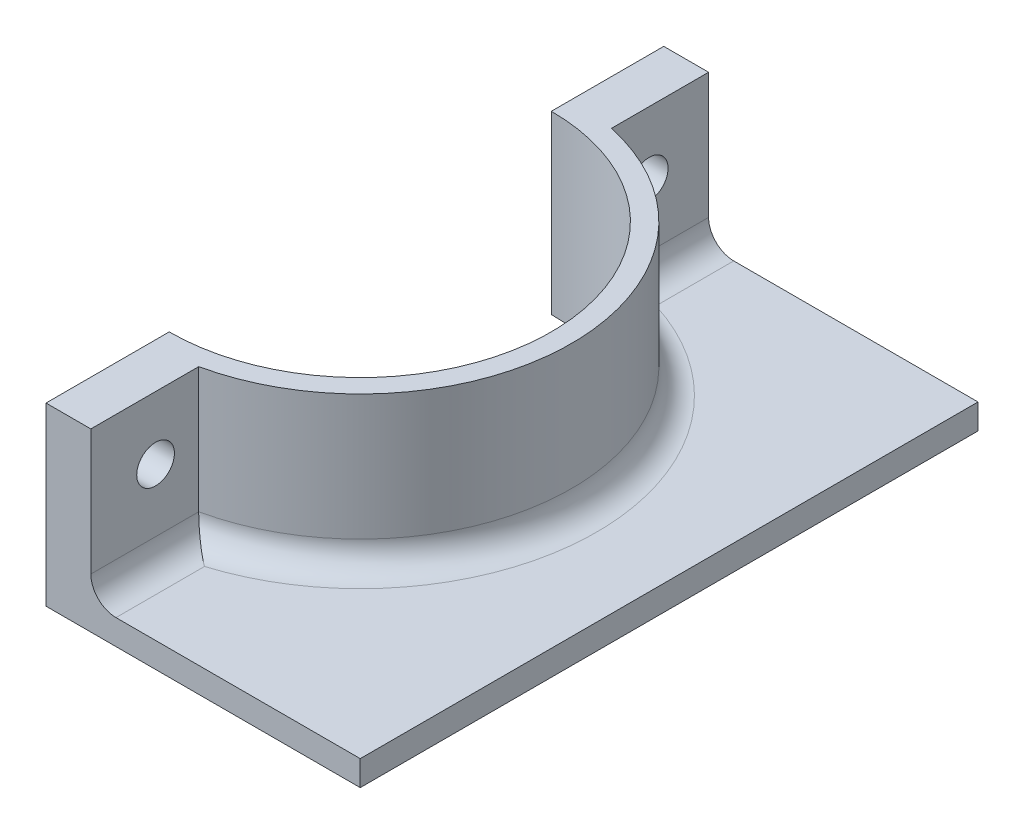
ISO-10303-21;
HEADER;
FILE_DESCRIPTION(('STEP AP214'),'2;1');
FILE_NAME('part.step','',(''),(''),'','','');
FILE_SCHEMA(('AUTOMOTIVE_DESIGN { 1 0 10303 214 1 1 1 1 }'));
ENDSEC;
DATA;
#1=APPLICATION_CONTEXT('core data for automotive mechanical design processes');
#2=APPLICATION_PROTOCOL_DEFINITION('international standard','automotive_design',2000,#1);
#3=PRODUCT_CONTEXT('',#1,'mechanical');
#4=PRODUCT('Part','Part','',(#3));
#5=PRODUCT_RELATED_PRODUCT_CATEGORY('part','',(#4));
#6=PRODUCT_DEFINITION_FORMATION('','',#4);
#7=PRODUCT_DEFINITION_CONTEXT('part definition',#1,'design');
#8=PRODUCT_DEFINITION('design','',#6,#7);
#9=PRODUCT_DEFINITION_SHAPE('','',#8);
#10=(LENGTH_UNIT() NAMED_UNIT(*) SI_UNIT(.MILLI.,.METRE.));
#11=(NAMED_UNIT(*) PLANE_ANGLE_UNIT() SI_UNIT($,.RADIAN.));
#12=(NAMED_UNIT(*) SI_UNIT($,.STERADIAN.) SOLID_ANGLE_UNIT());
#13=UNCERTAINTY_MEASURE_WITH_UNIT(LENGTH_MEASURE(1.E-05),#10,'distance_accuracy_value','');
#14=(GEOMETRIC_REPRESENTATION_CONTEXT(3) GLOBAL_UNCERTAINTY_ASSIGNED_CONTEXT((#13)) GLOBAL_UNIT_ASSIGNED_CONTEXT((#10,
#11,#12)) REPRESENTATION_CONTEXT('',''));
#15=CARTESIAN_POINT('',(0.,0.,0.));
#16=DIRECTION('',(0.,0.,1.));
#17=DIRECTION('',(1.,0.,0.));
#18=AXIS2_PLACEMENT_3D('',#15,#16,#17);
#19=CARTESIAN_POINT('',(29.9298320555893,17.78,0.));
#20=DIRECTION('',(-1.,0.,0.));
#21=DIRECTION('',(0.,0.,1.));
#22=AXIS2_PLACEMENT_3D('',#19,#20,#21);
#23=PLANE('',#22);
#24=CARTESIAN_POINT('',(29.9298320555893,11.43,-6.5405));
#25=DIRECTION('',(-1.,0.,0.));
#26=DIRECTION('',(0.,0.,1.));
#27=AXIS2_PLACEMENT_3D('',#24,#25,#26);
#28=CIRCLE('',#27,1.905);
#29=CARTESIAN_POINT('',(29.9298320555893,11.43,-4.6355));
#30=VERTEX_POINT('',#29);
#31=EDGE_CURVE('E342',#30,#30,#28,.F.);
#32=ORIENTED_EDGE('',*,*,#31,.F.);
#33=EDGE_LOOP('',(#32));
#34=FACE_BOUND('',#33,.T.);
#35=DIRECTION('',(0.,-1.,0.));
#36=VECTOR('',#35,1.);
#37=CARTESIAN_POINT('',(29.9298320555893,17.78,0.));
#38=LINE('',#37,#36);
#39=CARTESIAN_POINT('',(29.9298320555893,17.78,0.));
#40=VERTEX_POINT('',#39);
#41=CARTESIAN_POINT('',(29.9298320555893,5.08,0.));
#42=VERTEX_POINT('',#41);
#43=EDGE_CURVE('E202',#40,#42,#38,.T.);
#44=ORIENTED_EDGE('',*,*,#43,.T.);
#45=DIRECTION('',(0.,0.,-1.));
#46=VECTOR('',#45,1.);
#47=CARTESIAN_POINT('',(29.9298320555893,5.08,0.));
#48=LINE('',#47,#46);
#49=CARTESIAN_POINT('',(29.9298320555893,5.08,-10.9004072570193));
#50=VERTEX_POINT('',#49);
#51=EDGE_CURVE('E69',#42,#50,#48,.T.);
#52=ORIENTED_EDGE('',*,*,#51,.T.);
#53=DIRECTION('',(0.,-1.,0.));
#54=VECTOR('',#53,1.);
#55=CARTESIAN_POINT('',(29.9298320555893,17.78,-10.9004072570193));
#56=LINE('',#55,#54);
#57=CARTESIAN_POINT('',(29.9298320555893,17.78,-10.9004072570193));
#58=VERTEX_POINT('',#57);
#59=EDGE_CURVE('E238',#58,#50,#56,.T.);
#60=ORIENTED_EDGE('',*,*,#59,.F.);
#61=DIRECTION('',(0.,0.,-1.));
#62=VECTOR('',#61,1.);
#63=CARTESIAN_POINT('',(29.9298320555893,17.78,0.));
#64=LINE('',#63,#62);
#65=EDGE_CURVE('E175',#40,#58,#64,.T.);
#66=ORIENTED_EDGE('',*,*,#65,.F.);
#67=EDGE_LOOP('',(#44,#52,#60,#66));
#68=FACE_BOUND('',#67,.T.);
#69=ADVANCED_FACE('F45',(#34,#68),#23,.F.);
#70=CARTESIAN_POINT('',(25.4,17.78,-31.75));
#71=DIRECTION('',(0.,-1.,0.));
#72=DIRECTION('',(0.,0.,-1.));
#73=AXIS2_PLACEMENT_3D('',#70,#71,#72);
#74=CYLINDRICAL_SURFACE('',#73,21.336);
#75=ORIENTED_EDGE('',*,*,#59,.T.);
#76=CARTESIAN_POINT('',(25.4,5.08,-31.75));
#77=DIRECTION('',(0.,1.,0.));
#78=DIRECTION('',(0.,0.,1.));
#79=AXIS2_PLACEMENT_3D('',#76,#77,#78);
#80=CIRCLE('',#79,21.336);
#81=CARTESIAN_POINT('',(29.9298320555893,5.08,-52.5995927429807));
#82=VERTEX_POINT('',#81);
#83=EDGE_CURVE('E253',#50,#82,#80,.T.);
#84=ORIENTED_EDGE('',*,*,#83,.T.);
#85=DIRECTION('',(0.,-1.,0.));
#86=VECTOR('',#85,1.);
#87=CARTESIAN_POINT('',(29.9298320555893,17.78,-52.5995927429807));
#88=LINE('',#87,#86);
#89=CARTESIAN_POINT('',(29.9298320555893,17.78,-52.5995927429807));
#90=VERTEX_POINT('',#89);
#91=EDGE_CURVE('E234',#90,#82,#88,.T.);
#92=ORIENTED_EDGE('',*,*,#91,.F.);
#93=CARTESIAN_POINT('',(25.4,17.78,-31.75));
#94=DIRECTION('',(0.,1.,0.));
#95=DIRECTION('',(0.,0.,1.));
#96=AXIS2_PLACEMENT_3D('',#93,#94,#95);
#97=CIRCLE('',#96,21.336);
#98=EDGE_CURVE('E179',#58,#90,#97,.T.);
#99=ORIENTED_EDGE('',*,*,#98,.F.);
#100=EDGE_LOOP('',(#75,#84,#92,#99));
#101=FACE_BOUND('',#100,.T.);
#102=ADVANCED_FACE('F291',(#101),#74,.T.);
#103=CARTESIAN_POINT('',(29.9298320555893,17.78,0.));
#104=DIRECTION('',(1.,0.,0.));
#105=DIRECTION('',(0.,0.,-1.));
#106=AXIS2_PLACEMENT_3D('',#103,#104,#105);
#107=PLANE('',#106);
#108=CARTESIAN_POINT('',(29.9298320555893,11.43,-56.417624590122));
#109=DIRECTION('',(1.,0.,0.));
#110=DIRECTION('',(0.,0.,-1.));
#111=AXIS2_PLACEMENT_3D('',#108,#109,#110);
#112=CIRCLE('',#111,1.905);
#113=CARTESIAN_POINT('',(29.9298320555893,11.43,-58.322624590122));
#114=VERTEX_POINT('',#113);
#115=EDGE_CURVE('E268',#114,#114,#112,.F.);
#116=ORIENTED_EDGE('',*,*,#115,.T.);
#117=EDGE_LOOP('',(#116));
#118=FACE_BOUND('',#117,.T.);
#119=ORIENTED_EDGE('',*,*,#91,.T.);
#120=DIRECTION('',(0.,0.,1.));
#121=VECTOR('',#120,1.);
#122=CARTESIAN_POINT('',(29.9298320555893,5.08,-62.416249180244));
#123=LINE('',#122,#121);
#124=CARTESIAN_POINT('',(29.9298320555893,5.08,-62.416249180244));
#125=VERTEX_POINT('',#124);
#126=EDGE_CURVE('E250',#82,#125,#123,.F.);
#127=ORIENTED_EDGE('',*,*,#126,.T.);
#128=DIRECTION('',(0.,-1.,0.));
#129=VECTOR('',#128,1.);
#130=CARTESIAN_POINT('',(29.9298320555893,17.78,-62.416249180244));
#131=LINE('',#130,#129);
#132=CARTESIAN_POINT('',(29.9298320555893,17.78,-62.416249180244));
#133=VERTEX_POINT('',#132);
#134=EDGE_CURVE('E230',#133,#125,#131,.T.);
#135=ORIENTED_EDGE('',*,*,#134,.F.);
#136=DIRECTION('',(0.,0.,1.));
#137=VECTOR('',#136,1.);
#138=CARTESIAN_POINT('',(29.9298320555893,17.78,0.));
#139=LINE('',#138,#137);
#140=EDGE_CURVE('E182',#133,#90,#139,.T.);
#141=ORIENTED_EDGE('',*,*,#140,.T.);
#142=EDGE_LOOP('',(#119,#127,#135,#141));
#143=FACE_BOUND('',#142,.T.);
#144=ADVANCED_FACE('F296',(#118,#143),#107,.T.);
#145=CARTESIAN_POINT('',(0.,17.78,-62.416249180244));
#146=DIRECTION('',(0.,0.,-1.));
#147=DIRECTION('',(-1.,0.,0.));
#148=AXIS2_PLACEMENT_3D('',#145,#146,#147);
#149=PLANE('',#148);
#150=DIRECTION('',(1.,0.,0.));
#151=VECTOR('',#150,1.);
#152=CARTESIAN_POINT('',(0.,0.,-62.416249180244));
#153=LINE('',#152,#151);
#154=CARTESIAN_POINT('',(25.4,0.,-62.416249180244));
#155=VERTEX_POINT('',#154);
#156=CARTESIAN_POINT('',(57.15,0.,-62.416249180244));
#157=VERTEX_POINT('',#156);
#158=EDGE_CURVE('E147',#155,#157,#153,.T.);
#159=ORIENTED_EDGE('',*,*,#158,.F.);
#160=DIRECTION('',(0.,-1.,0.));
#161=VECTOR('',#160,1.);
#162=CARTESIAN_POINT('',(25.4,17.78,-62.416249180244));
#163=LINE('',#162,#161);
#164=CARTESIAN_POINT('',(25.4,17.78,-62.416249180244));
#165=VERTEX_POINT('',#164);
#166=EDGE_CURVE('E227',#165,#155,#163,.T.);
#167=ORIENTED_EDGE('',*,*,#166,.F.);
#168=DIRECTION('',(1.,0.,0.));
#169=VECTOR('',#168,1.);
#170=CARTESIAN_POINT('',(0.,17.78,-62.416249180244));
#171=LINE('',#170,#169);
#172=EDGE_CURVE('E186',#165,#133,#171,.T.);
#173=ORIENTED_EDGE('',*,*,#172,.T.);
#174=ORIENTED_EDGE('',*,*,#134,.T.);
#175=CARTESIAN_POINT('',(32.4698320555893,5.08,-62.416249180244));
#176=DIRECTION('',(0.,0.,-1.));
#177=DIRECTION('',(-1.,0.,0.));
#178=AXIS2_PLACEMENT_3D('',#175,#176,#177);
#179=CIRCLE('',#178,2.54);
#180=CARTESIAN_POINT('',(32.4698320555893,2.54,-62.416249180244));
#181=VERTEX_POINT('',#180);
#182=EDGE_CURVE('E56',#125,#181,#179,.F.);
#183=ORIENTED_EDGE('',*,*,#182,.T.);
#184=DIRECTION('',(1.,0.,0.));
#185=VECTOR('',#184,1.);
#186=CARTESIAN_POINT('',(0.,2.54,-62.416249180244));
#187=LINE('',#186,#185);
#188=CARTESIAN_POINT('',(57.15,2.54,-62.416249180244));
#189=VERTEX_POINT('',#188);
#190=EDGE_CURVE('E164',#181,#189,#187,.T.);
#191=ORIENTED_EDGE('',*,*,#190,.T.);
#192=DIRECTION('',(0.,-1.,0.));
#193=VECTOR('',#192,1.);
#194=CARTESIAN_POINT('',(57.15,2.54,-62.416249180244));
#195=LINE('',#194,#193);
#196=EDGE_CURVE('E148',#189,#157,#195,.T.);
#197=ORIENTED_EDGE('',*,*,#196,.T.);
#198=EDGE_LOOP('',(#159,#167,#173,#174,#183,#191,#197));
#199=FACE_BOUND('',#198,.T.);
#200=ADVANCED_FACE('F303',(#199),#149,.T.);
#201=CARTESIAN_POINT('',(25.4,17.78,0.));
#202=DIRECTION('',(1.,0.,0.));
#203=DIRECTION('',(0.,0.,-1.));
#204=AXIS2_PLACEMENT_3D('',#201,#202,#203);
#205=PLANE('',#204);
#206=CARTESIAN_POINT('',(25.4,11.43,-56.417624590122));
#207=DIRECTION('',(1.,0.,0.));
#208=DIRECTION('',(0.,0.,-1.));
#209=AXIS2_PLACEMENT_3D('',#206,#207,#208);
#210=CIRCLE('',#209,1.905);
#211=CARTESIAN_POINT('',(25.4,11.43,-58.322624590122));
#212=VERTEX_POINT('',#211);
#213=EDGE_CURVE('E50',#212,#212,#210,.F.);
#214=ORIENTED_EDGE('',*,*,#213,.F.);
#215=EDGE_LOOP('',(#214));
#216=FACE_BOUND('',#215,.T.);
#217=DIRECTION('',(0.,0.,1.));
#218=VECTOR('',#217,1.);
#219=CARTESIAN_POINT('',(25.4,0.,0.));
#220=LINE('',#219,#218);
#221=CARTESIAN_POINT('',(25.4,0.,-51.054));
#222=VERTEX_POINT('',#221);
#223=EDGE_CURVE('E205',#155,#222,#220,.T.);
#224=ORIENTED_EDGE('',*,*,#223,.T.);
#225=DIRECTION('',(0.,-1.,0.));
#226=VECTOR('',#225,1.);
#227=CARTESIAN_POINT('',(25.4,17.78,-51.054));
#228=LINE('',#227,#226);
#229=CARTESIAN_POINT('',(25.4,17.78,-51.054));
#230=VERTEX_POINT('',#229);
#231=EDGE_CURVE('E224',#230,#222,#228,.T.);
#232=ORIENTED_EDGE('',*,*,#231,.F.);
#233=DIRECTION('',(0.,0.,1.));
#234=VECTOR('',#233,1.);
#235=CARTESIAN_POINT('',(25.4,17.78,0.));
#236=LINE('',#235,#234);
#237=EDGE_CURVE('E190',#165,#230,#236,.T.);
#238=ORIENTED_EDGE('',*,*,#237,.F.);
#239=ORIENTED_EDGE('',*,*,#166,.T.);
#240=EDGE_LOOP('',(#224,#232,#238,#239));
#241=FACE_BOUND('',#240,.T.);
#242=ADVANCED_FACE('F307',(#216,#241),#205,.F.);
#243=CARTESIAN_POINT('',(25.4,17.78,-31.75));
#244=DIRECTION('',(0.,-1.,0.));
#245=DIRECTION('',(0.,0.,-1.));
#246=AXIS2_PLACEMENT_3D('',#243,#244,#245);
#247=CYLINDRICAL_SURFACE('',#246,19.304);
#248=CARTESIAN_POINT('',(25.4,0.,-31.75));
#249=DIRECTION('',(0.,1.,0.));
#250=DIRECTION('',(0.,0.,1.));
#251=AXIS2_PLACEMENT_3D('',#248,#249,#250);
#252=CIRCLE('',#251,19.304);
#253=CARTESIAN_POINT('',(25.4,0.,-12.446));
#254=VERTEX_POINT('',#253);
#255=EDGE_CURVE('E209',#254,#222,#252,.T.);
#256=ORIENTED_EDGE('',*,*,#255,.F.);
#257=DIRECTION('',(0.,-1.,0.));
#258=VECTOR('',#257,1.);
#259=CARTESIAN_POINT('',(25.4,17.78,-12.446));
#260=LINE('',#259,#258);
#261=CARTESIAN_POINT('',(25.4,17.78,-12.446));
#262=VERTEX_POINT('',#261);
#263=EDGE_CURVE('E221',#262,#254,#260,.T.);
#264=ORIENTED_EDGE('',*,*,#263,.F.);
#265=CARTESIAN_POINT('',(25.4,17.78,-31.75));
#266=DIRECTION('',(0.,1.,0.));
#267=DIRECTION('',(0.,0.,1.));
#268=AXIS2_PLACEMENT_3D('',#265,#266,#267);
#269=CIRCLE('',#268,19.304);
#270=EDGE_CURVE('E193',#262,#230,#269,.T.);
#271=ORIENTED_EDGE('',*,*,#270,.T.);
#272=ORIENTED_EDGE('',*,*,#231,.T.);
#273=EDGE_LOOP('',(#256,#264,#271,#272));
#274=FACE_BOUND('',#273,.T.);
#275=ADVANCED_FACE('F309',(#274),#247,.F.);
#276=CARTESIAN_POINT('',(25.4,11.43,-6.5405));
#277=DIRECTION('',(1.,0.,0.));
#278=DIRECTION('',(0.,0.,-1.));
#279=AXIS2_PLACEMENT_3D('',#276,#277,#278);
#280=CIRCLE('',#279,1.905);
#281=CARTESIAN_POINT('',(25.4,11.43,-8.4455));
#282=VERTEX_POINT('',#281);
#283=EDGE_CURVE('E346',#282,#282,#280,.F.);
#284=ORIENTED_EDGE('',*,*,#283,.F.);
#285=EDGE_LOOP('',(#284));
#286=FACE_BOUND('',#285,.T.);
#287=CARTESIAN_POINT('',(25.4,0.,0.));
#288=VERTEX_POINT('',#287);
#289=EDGE_CURVE('E210',#254,#288,#220,.T.);
#290=ORIENTED_EDGE('',*,*,#289,.T.);
#291=DIRECTION('',(0.,-1.,0.));
#292=VECTOR('',#291,1.);
#293=CARTESIAN_POINT('',(25.4,17.78,0.));
#294=LINE('',#293,#292);
#295=CARTESIAN_POINT('',(25.4,17.78,0.));
#296=VERTEX_POINT('',#295);
#297=EDGE_CURVE('E218',#296,#288,#294,.T.);
#298=ORIENTED_EDGE('',*,*,#297,.F.);
#299=EDGE_CURVE('E194',#262,#296,#236,.T.);
#300=ORIENTED_EDGE('',*,*,#299,.F.);
#301=ORIENTED_EDGE('',*,*,#263,.T.);
#302=EDGE_LOOP('',(#290,#298,#300,#301));
#303=FACE_BOUND('',#302,.T.);
#304=ADVANCED_FACE('F312',(#286,#303),#205,.F.);
#305=CARTESIAN_POINT('',(0.,17.78,0.));
#306=DIRECTION('',(0.,0.,1.));
#307=DIRECTION('',(1.,0.,0.));
#308=AXIS2_PLACEMENT_3D('',#305,#306,#307);
#309=PLANE('',#308);
#310=DIRECTION('',(-1.,0.,0.));
#311=VECTOR('',#310,1.);
#312=CARTESIAN_POINT('',(0.,0.,0.));
#313=LINE('',#312,#311);
#314=CARTESIAN_POINT('',(57.15,0.,0.));
#315=VERTEX_POINT('',#314);
#316=EDGE_CURVE('E141',#315,#288,#313,.T.);
#317=ORIENTED_EDGE('',*,*,#316,.F.);
#318=DIRECTION('',(0.,-1.,0.));
#319=VECTOR('',#318,1.);
#320=CARTESIAN_POINT('',(57.15,2.54,0.));
#321=LINE('',#320,#319);
#322=CARTESIAN_POINT('',(57.15,2.54,0.));
#323=VERTEX_POINT('',#322);
#324=EDGE_CURVE('E136',#323,#315,#321,.T.);
#325=ORIENTED_EDGE('',*,*,#324,.F.);
#326=DIRECTION('',(-1.,0.,0.));
#327=VECTOR('',#326,1.);
#328=CARTESIAN_POINT('',(0.,2.54,0.));
#329=LINE('',#328,#327);
#330=CARTESIAN_POINT('',(32.4698320555893,2.54,0.));
#331=VERTEX_POINT('',#330);
#332=EDGE_CURVE('E139',#323,#331,#329,.T.);
#333=ORIENTED_EDGE('',*,*,#332,.T.);
#334=CARTESIAN_POINT('',(32.4698320555893,5.08,0.));
#335=DIRECTION('',(0.,0.,1.));
#336=DIRECTION('',(1.,0.,0.));
#337=AXIS2_PLACEMENT_3D('',#334,#335,#336);
#338=CIRCLE('',#337,2.54);
#339=EDGE_CURVE('E11',#331,#42,#338,.F.);
#340=ORIENTED_EDGE('',*,*,#339,.T.);
#341=ORIENTED_EDGE('',*,*,#43,.F.);
#342=DIRECTION('',(-1.,0.,0.));
#343=VECTOR('',#342,1.);
#344=CARTESIAN_POINT('',(0.,17.78,0.));
#345=LINE('',#344,#343);
#346=EDGE_CURVE('E198',#40,#296,#345,.T.);
#347=ORIENTED_EDGE('',*,*,#346,.T.);
#348=ORIENTED_EDGE('',*,*,#297,.T.);
#349=EDGE_LOOP('',(#317,#325,#333,#340,#341,#347,#348));
#350=FACE_BOUND('',#349,.T.);
#351=ADVANCED_FACE('F138',(#350),#309,.T.);
#352=CARTESIAN_POINT('',(0.,17.78,0.));
#353=DIRECTION('',(0.,1.,0.));
#354=DIRECTION('',(0.,0.,1.));
#355=AXIS2_PLACEMENT_3D('',#352,#353,#354);
#356=PLANE('',#355);
#357=ORIENTED_EDGE('',*,*,#65,.T.);
#358=ORIENTED_EDGE('',*,*,#98,.T.);
#359=ORIENTED_EDGE('',*,*,#140,.F.);
#360=ORIENTED_EDGE('',*,*,#172,.F.);
#361=ORIENTED_EDGE('',*,*,#237,.T.);
#362=ORIENTED_EDGE('',*,*,#270,.F.);
#363=ORIENTED_EDGE('',*,*,#299,.T.);
#364=ORIENTED_EDGE('',*,*,#346,.F.);
#365=EDGE_LOOP('',(#357,#358,#359,#360,#361,#362,#363,#364));
#366=FACE_BOUND('',#365,.T.);
#367=ADVANCED_FACE('F319',(#366),#356,.T.);
#368=CARTESIAN_POINT('',(0.,0.,0.));
#369=DIRECTION('',(0.,1.,0.));
#370=DIRECTION('',(0.,0.,1.));
#371=AXIS2_PLACEMENT_3D('',#368,#369,#370);
#372=PLANE('',#371);
#373=DIRECTION('',(0.,0.,1.));
#374=VECTOR('',#373,1.);
#375=CARTESIAN_POINT('',(57.15,0.,0.));
#376=LINE('',#375,#374);
#377=EDGE_CURVE('E158',#157,#315,#376,.T.);
#378=ORIENTED_EDGE('',*,*,#377,.T.);
#379=ORIENTED_EDGE('',*,*,#316,.T.);
#380=ORIENTED_EDGE('',*,*,#289,.F.);
#381=ORIENTED_EDGE('',*,*,#255,.T.);
#382=ORIENTED_EDGE('',*,*,#223,.F.);
#383=ORIENTED_EDGE('',*,*,#158,.T.);
#384=EDGE_LOOP('',(#378,#379,#380,#381,#382,#383));
#385=FACE_BOUND('',#384,.T.);
#386=ADVANCED_FACE('F320',(#385),#372,.F.);
#387=CARTESIAN_POINT('',(57.15,2.54,0.));
#388=DIRECTION('',(1.,0.,0.));
#389=DIRECTION('',(0.,0.,-1.));
#390=AXIS2_PLACEMENT_3D('',#387,#388,#389);
#391=PLANE('',#390);
#392=ORIENTED_EDGE('',*,*,#377,.F.);
#393=ORIENTED_EDGE('',*,*,#196,.F.);
#394=DIRECTION('',(0.,0.,1.));
#395=VECTOR('',#394,1.);
#396=CARTESIAN_POINT('',(57.15,2.54,0.));
#397=LINE('',#396,#395);
#398=EDGE_CURVE('E154',#189,#323,#397,.T.);
#399=ORIENTED_EDGE('',*,*,#398,.T.);
#400=ORIENTED_EDGE('',*,*,#324,.T.);
#401=EDGE_LOOP('',(#392,#393,#399,#400));
#402=FACE_BOUND('',#401,.T.);
#403=ADVANCED_FACE('F161',(#402),#391,.T.);
#404=CARTESIAN_POINT('',(0.,2.54,0.));
#405=DIRECTION('',(0.,1.,0.));
#406=DIRECTION('',(0.,0.,1.));
#407=AXIS2_PLACEMENT_3D('',#404,#405,#406);
#408=PLANE('',#407);
#409=ORIENTED_EDGE('',*,*,#190,.F.);
#410=DIRECTION('',(0.,0.,1.));
#411=VECTOR('',#410,1.);
#412=CARTESIAN_POINT('',(32.4698320555893,2.54,-52.5995927429807));
#413=LINE('',#412,#411);
#414=CARTESIAN_POINT('',(32.4698320555893,2.54,-54.555281202076));
#415=VERTEX_POINT('',#414);
#416=EDGE_CURVE('E246',#181,#415,#413,.T.);
#417=ORIENTED_EDGE('',*,*,#416,.T.);
#418=CARTESIAN_POINT('',(25.4,2.54,-31.75));
#419=DIRECTION('',(0.,1.,0.));
#420=DIRECTION('',(0.,0.,1.));
#421=AXIS2_PLACEMENT_3D('',#418,#419,#420);
#422=CIRCLE('',#421,23.876);
#423=CARTESIAN_POINT('',(32.4698320555893,2.54,-8.94471879792398));
#424=VERTEX_POINT('',#423);
#425=EDGE_CURVE('E243',#415,#424,#422,.F.);
#426=ORIENTED_EDGE('',*,*,#425,.T.);
#427=DIRECTION('',(0.,0.,-1.));
#428=VECTOR('',#427,1.);
#429=CARTESIAN_POINT('',(32.4698320555893,2.54,0.));
#430=LINE('',#429,#428);
#431=EDGE_CURVE('E156',#424,#331,#430,.F.);
#432=ORIENTED_EDGE('',*,*,#431,.T.);
#433=ORIENTED_EDGE('',*,*,#332,.F.);
#434=ORIENTED_EDGE('',*,*,#398,.F.);
#435=EDGE_LOOP('',(#409,#417,#426,#432,#433,#434));
#436=FACE_BOUND('',#435,.T.);
#437=ADVANCED_FACE('F153',(#436),#408,.T.);
#438=CARTESIAN_POINT('',(32.4698320555893,5.08,0.));
#439=DIRECTION('',(0.,0.,-1.));
#440=DIRECTION('',(-1.,0.,0.));
#441=AXIS2_PLACEMENT_3D('',#438,#439,#440);
#442=CYLINDRICAL_SURFACE('',#441,2.54);
#443=ORIENTED_EDGE('',*,*,#339,.F.);
#444=ORIENTED_EDGE('',*,*,#431,.F.);
#445=CARTESIAN_POINT('',(29.9298320555893,5.08,-10.9004072570193));
#446=CARTESIAN_POINT('',(29.9298189767598,5.01947008584814,-10.9004186931537));
#447=CARTESIAN_POINT('',(29.9319953346922,4.95894926315979,-10.8986635284363));
#448=CARTESIAN_POINT('',(29.9406263790634,4.83844714540674,-10.8917075979104));
#449=CARTESIAN_POINT('',(29.9470785680884,4.77846555610398,-10.8865088434237));
#450=CARTESIAN_POINT('',(29.9641047423556,4.65988290248846,-10.8727984036691));
#451=CARTESIAN_POINT('',(29.9746513262495,4.60127535122768,-10.8643087430335));
#452=CARTESIAN_POINT('',(29.9996803365515,4.48547086791238,-10.8441782583122));
#453=CARTESIAN_POINT('',(30.0141631412065,4.42827407199926,-10.8325371313902));
#454=CARTESIAN_POINT('',(30.0631290815838,4.25961588969206,-10.7932199171705));
#455=CARTESIAN_POINT('',(30.103182251385,4.1507331498832,-10.7611075482907));
#456=CARTESIAN_POINT('',(30.1960529712556,3.94218681087414,-10.6868759262093));
#457=CARTESIAN_POINT('',(30.2488902889648,3.84253782272534,-10.644741177506));
#458=CARTESIAN_POINT('',(30.3698055629717,3.6461869641249,-10.5486666357273));
#459=CARTESIAN_POINT('',(30.4387663494452,3.55036347043179,-10.4940508050211));
#460=CARTESIAN_POINT('',(30.5865246572976,3.37172312569228,-10.3775436923927));
#461=CARTESIAN_POINT('',(30.6653240977918,3.28890881933765,-10.3156509911912));
#462=CARTESIAN_POINT('',(30.8483500233042,3.12014913111811,-10.1725769727366));
#463=CARTESIAN_POINT('',(30.9544155471725,3.03730140365821,-10.0900968153693));
#464=CARTESIAN_POINT('',(31.1750604817958,2.89076724042379,-9.91956596562844));
#465=CARTESIAN_POINT('',(31.2896502267806,2.82710455144658,-9.83150853157239));
#466=CARTESIAN_POINT('',(31.549602651373,2.70737777244191,-9.63300242298332));
#467=CARTESIAN_POINT('',(31.6963727241712,2.65571990965629,-9.52173619490261));
#468=CARTESIAN_POINT('',(31.9949760048426,2.5800432146939,-9.29710657953994));
#469=CARTESIAN_POINT('',(32.1468009387368,2.55598130023189,-9.18374674271004));
#470=CARTESIAN_POINT('',(32.3534145182948,2.54209380201909,-9.03063832024806));
#471=CARTESIAN_POINT('',(32.4074454599568,2.54019031779196,-8.99070560380833));
#472=CARTESIAN_POINT('',(32.4642970987544,2.54000452481026,-8.94879801383154));
#473=CARTESIAN_POINT('',(32.4670645108929,2.54000000176988,-8.94675831820909));
#474=CARTESIAN_POINT('',(32.4698320555893,2.54,-8.94471879792398));
#475=B_SPLINE_CURVE_WITH_KNOTS('',3,(#445,#446,#447,#448,#449,#450,#451,#452,#453,#454,#455,
#456,#457,#458,#459,#460,#461,#462,#463,#464,#465,#466,#467,#468,#469,#470,#471,#472,#473,#474),
.UNSPECIFIED.,.F.,.F.,(4,2,2,2,2,2,2,2,2,2,2,2,2,2,4),(0.,0.181510291158383,0.362914659697582,
0.543125362795527,0.723353389166492,1.08274370549116,1.44269332522132,1.83153127452596,
2.22044518890873,2.69228688912453,3.16471024765354,3.73638373724548,4.30716352060647,
4.50873549755396,4.51904909793667),.UNSPECIFIED.);
#476=EDGE_CURVE('E172',#50,#424,#475,.T.);
#477=ORIENTED_EDGE('',*,*,#476,.F.);
#478=ORIENTED_EDGE('',*,*,#51,.F.);
#479=EDGE_LOOP('',(#443,#444,#477,#478));
#480=FACE_BOUND('',#479,.T.);
#481=ADVANCED_FACE('F47',(#480),#442,.F.);
#482=CARTESIAN_POINT('',(25.4,5.08,-31.75));
#483=DIRECTION('',(0.,1.,0.));
#484=DIRECTION('',(0.,0.,1.));
#485=AXIS2_PLACEMENT_3D('',#482,#483,#484);
#486=TOROIDAL_SURFACE('',#485,23.876,2.54);
#487=ORIENTED_EDGE('',*,*,#476,.T.);
#488=ORIENTED_EDGE('',*,*,#425,.F.);
#489=CARTESIAN_POINT('',(29.9298320555893,5.08,-52.5995927429807));
#490=CARTESIAN_POINT('',(29.9298189767598,5.01947008584814,-52.5995813068463));
#491=CARTESIAN_POINT('',(29.9319953346922,4.95894926315979,-52.6013364715637));
#492=CARTESIAN_POINT('',(29.9406263790634,4.83844714540674,-52.6082924020896));
#493=CARTESIAN_POINT('',(29.9470785680884,4.77846555610398,-52.6134911565763));
#494=CARTESIAN_POINT('',(29.9641047423556,4.65988290248846,-52.6272015963309));
#495=CARTESIAN_POINT('',(29.9746513262494,4.60127535122768,-52.6356912569665));
#496=CARTESIAN_POINT('',(29.9996803365515,4.48547086791238,-52.6558217416878));
#497=CARTESIAN_POINT('',(30.0141631412065,4.42827407199926,-52.6674628686098));
#498=CARTESIAN_POINT('',(30.0631290815838,4.25961588969206,-52.7067800828295));
#499=CARTESIAN_POINT('',(30.103182251385,4.1507331498832,-52.7388924517093));
#500=CARTESIAN_POINT('',(30.1960529712556,3.94218681087413,-52.8131240737907));
#501=CARTESIAN_POINT('',(30.2488902889648,3.84253782272534,-52.855258822494));
#502=CARTESIAN_POINT('',(30.3698055629717,3.6461869641249,-52.9513333642727));
#503=CARTESIAN_POINT('',(30.4387663494452,3.55036347043179,-53.0059491949789));
#504=CARTESIAN_POINT('',(30.5865246572976,3.37172312569228,-53.1224563076073));
#505=CARTESIAN_POINT('',(30.6653240977918,3.28890881933765,-53.1843490088088));
#506=CARTESIAN_POINT('',(30.8483500233042,3.1201491311181,-53.3274230272634));
#507=CARTESIAN_POINT('',(30.9544155471725,3.0373014036582,-53.4099031846307));
#508=CARTESIAN_POINT('',(31.1750604817959,2.89076724042379,-53.5804340343715));
#509=CARTESIAN_POINT('',(31.2896502267807,2.82710455144657,-53.6684914684276));
#510=CARTESIAN_POINT('',(31.549602651373,2.70737777244191,-53.8669975770167));
#511=CARTESIAN_POINT('',(31.6963727241711,2.65571990965629,-53.9782638050976));
#512=CARTESIAN_POINT('',(31.9949760048428,2.5800432146939,-54.2028934204598));
#513=CARTESIAN_POINT('',(32.1468009387374,2.55598130023189,-54.3162532572891));
#514=CARTESIAN_POINT('',(32.3534145182946,2.54209380201909,-54.4693616797522));
#515=CARTESIAN_POINT('',(32.4074454599562,2.54019031779196,-54.5092943961924));
#516=CARTESIAN_POINT('',(32.4642970987543,2.54000452481026,-54.5512019861685));
#517=CARTESIAN_POINT('',(32.4670645108928,2.54000000176988,-54.553241681791));
#518=CARTESIAN_POINT('',(32.4698320555893,2.54,-54.555281202076));
#519=B_SPLINE_CURVE_WITH_KNOTS('',3,(#489,#490,#491,#492,#493,#494,#495,#496,#497,#498,#499,
#500,#501,#502,#503,#504,#505,#506,#507,#508,#509,#510,#511,#512,#513,#514,#515,#516,#517,#518),
.UNSPECIFIED.,.F.,.F.,(4,2,2,2,2,2,2,2,2,2,2,2,2,2,4),(0.,0.181510291158383,0.362914659697582,
0.543125362795526,0.723353389166493,1.08274370549116,1.44269332522132,1.83153127452596,
2.22044518890873,2.69228688912454,3.16471024765354,3.73638373724547,4.30716352060648,
4.50873549755395,4.51904909793668),.UNSPECIFIED.);
#520=EDGE_CURVE('E260',#82,#415,#519,.T.);
#521=ORIENTED_EDGE('',*,*,#520,.F.);
#522=ORIENTED_EDGE('',*,*,#83,.F.);
#523=EDGE_LOOP('',(#487,#488,#521,#522));
#524=FACE_BOUND('',#523,.T.);
#525=ADVANCED_FACE('F273',(#524),#486,.F.);
#526=CARTESIAN_POINT('',(32.4698320555893,5.08,0.));
#527=DIRECTION('',(0.,0.,-1.));
#528=DIRECTION('',(-1.,0.,0.));
#529=AXIS2_PLACEMENT_3D('',#526,#527,#528);
#530=CYLINDRICAL_SURFACE('',#529,2.54);
#531=ORIENTED_EDGE('',*,*,#182,.F.);
#532=ORIENTED_EDGE('',*,*,#126,.F.);
#533=ORIENTED_EDGE('',*,*,#520,.T.);
#534=ORIENTED_EDGE('',*,*,#416,.F.);
#535=EDGE_LOOP('',(#531,#532,#533,#534));
#536=FACE_BOUND('',#535,.T.);
#537=ADVANCED_FACE('F276',(#536),#530,.F.);
#538=CARTESIAN_POINT('',(25.4,11.43,-6.5405));
#539=DIRECTION('',(-1.,0.,0.));
#540=DIRECTION('',(0.,0.,1.));
#541=AXIS2_PLACEMENT_3D('',#538,#539,#540);
#542=CYLINDRICAL_SURFACE('',#541,1.905);
#543=ORIENTED_EDGE('',*,*,#283,.T.);
#544=EDGE_LOOP('',(#543));
#545=FACE_BOUND('',#544,.T.);
#546=ORIENTED_EDGE('',*,*,#31,.T.);
#547=EDGE_LOOP('',(#546));
#548=FACE_BOUND('',#547,.T.);
#549=ADVANCED_FACE('F279',(#545,#548),#542,.F.);
#550=CARTESIAN_POINT('',(25.4,11.43,-56.417624590122));
#551=DIRECTION('',(-1.,0.,0.));
#552=DIRECTION('',(0.,0.,1.));
#553=AXIS2_PLACEMENT_3D('',#550,#551,#552);
#554=CYLINDRICAL_SURFACE('',#553,1.905);
#555=ORIENTED_EDGE('',*,*,#115,.F.);
#556=EDGE_LOOP('',(#555));
#557=FACE_BOUND('',#556,.T.);
#558=ORIENTED_EDGE('',*,*,#213,.T.);
#559=EDGE_LOOP('',(#558));
#560=FACE_BOUND('',#559,.T.);
#561=ADVANCED_FACE('F285',(#557,#560),#554,.F.);
#562=CLOSED_SHELL('',(#69,#102,#144,#200,#242,#275,#304,#351,#367,#386,#403,#437,#481,#525,#537,
#549,#561));
#563=MANIFOLD_SOLID_BREP('B2',#562);
#564=ADVANCED_BREP_SHAPE_REPRESENTATION('',(#18,#563),#14);
#565=SHAPE_DEFINITION_REPRESENTATION(#9,#564);
ENDSEC;
END-ISO-10303-21;
